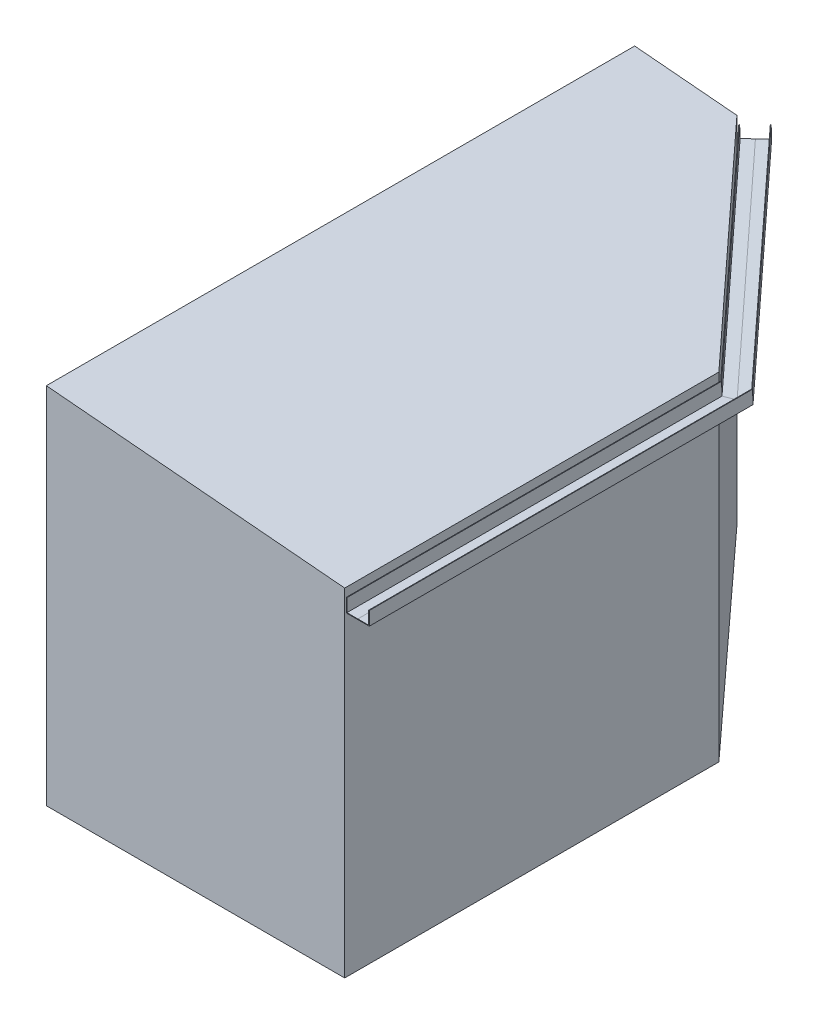
ISO-10303-21;
HEADER;
FILE_DESCRIPTION(('STEP AP214'),'2;1');
FILE_NAME('part.step','',(''),(''),'','','');
FILE_SCHEMA(('AUTOMOTIVE_DESIGN { 1 0 10303 214 1 1 1 1 }'));
ENDSEC;
DATA;
#1=APPLICATION_CONTEXT('core data for automotive mechanical design processes');
#2=APPLICATION_PROTOCOL_DEFINITION('international standard','automotive_design',2000,#1);
#3=PRODUCT_CONTEXT('',#1,'mechanical');
#4=PRODUCT('Part','Part','',(#3));
#5=PRODUCT_RELATED_PRODUCT_CATEGORY('part','',(#4));
#6=PRODUCT_DEFINITION_FORMATION('','',#4);
#7=PRODUCT_DEFINITION_CONTEXT('part definition',#1,'design');
#8=PRODUCT_DEFINITION('design','',#6,#7);
#9=PRODUCT_DEFINITION_SHAPE('','',#8);
#10=(LENGTH_UNIT() NAMED_UNIT(*) SI_UNIT(.MILLI.,.METRE.));
#11=(NAMED_UNIT(*) PLANE_ANGLE_UNIT() SI_UNIT($,.RADIAN.));
#12=(NAMED_UNIT(*) SI_UNIT($,.STERADIAN.) SOLID_ANGLE_UNIT());
#13=UNCERTAINTY_MEASURE_WITH_UNIT(LENGTH_MEASURE(1.E-05),#10,'distance_accuracy_value','');
#14=(GEOMETRIC_REPRESENTATION_CONTEXT(3) GLOBAL_UNCERTAINTY_ASSIGNED_CONTEXT((#13)) GLOBAL_UNIT_ASSIGNED_CONTEXT((#10,
#11,#12)) REPRESENTATION_CONTEXT('',''));
#15=CARTESIAN_POINT('',(0.,0.,0.));
#16=DIRECTION('',(0.,0.,1.));
#17=DIRECTION('',(1.,0.,0.));
#18=AXIS2_PLACEMENT_3D('',#15,#16,#17);
#19=CARTESIAN_POINT('',(184.691152989255,2656.,-3207.30460485348));
#20=DIRECTION('',(0.0229028027264186,0.997996264398468,0.0589823522248682));
#21=DIRECTION('',(0.,-0.0589978275667201,0.998258111082704));
#22=AXIS2_PLACEMENT_3D('',#19,#20,#21);
#23=PLANE('',#22);
#24=DIRECTION('',(-0.738219766957211,-0.0229028027264186,0.674171370870134));
#25=VECTOR('',#24,1.);
#26=CARTESIAN_POINT('',(-1506.91022039486,2803.99594337599,-5054.5857318187));
#27=LINE('',#26,#25);
#28=CARTESIAN_POINT('',(-1562.04870594835,2802.28530663367,-5004.23109481606));
#29=VERTEX_POINT('',#28);
#30=CARTESIAN_POINT('',(-1632.91780357625,2800.08663757194,-4939.51064321253));
#31=VERTEX_POINT('',#30);
#32=EDGE_CURVE('E61',#29,#31,#27,.T.);
#33=ORIENTED_EDGE('',*,*,#32,.F.);
#34=DIRECTION('',(-0.674171370870134,0.0589823522248682,-0.736216031355679));
#35=VECTOR('',#34,1.);
#36=CARTESIAN_POINT('',(110.,2656.,-3178.30208667991));
#37=LINE('',#36,#35);
#38=CARTESIAN_POINT('',(110.,2656.,-3178.30208667991));
#39=VERTEX_POINT('',#38);
#40=EDGE_CURVE('E256',#39,#29,#37,.T.);
#41=ORIENTED_EDGE('',*,*,#40,.F.);
#42=DIRECTION('',(0.932190225959348,0.,-0.361968759184904));
#43=VECTOR('',#42,1.);
#44=CARTESIAN_POINT('',(184.691152989255,2656.,-3207.30460485348));
#45=LINE('',#44,#43);
#46=CARTESIAN_POINT('',(13.9999999999984,2656.,-3141.02535934028));
#47=VERTEX_POINT('',#46);
#48=EDGE_CURVE('E319',#47,#39,#45,.T.);
#49=ORIENTED_EDGE('',*,*,#48,.F.);
#50=DIRECTION('',(-0.674171370870134,0.0589823522248682,-0.736216031355679));
#51=VECTOR('',#50,1.);
#52=CARTESIAN_POINT('',(13.9999999999984,2656.,-3141.02535934028));
#53=LINE('',#52,#51);
#54=EDGE_CURVE('E282',#47,#31,#53,.T.);
#55=ORIENTED_EDGE('',*,*,#54,.T.);
#56=EDGE_LOOP('',(#33,#41,#49,#55));
#57=FACE_BOUND('',#56,.T.);
#58=ADVANCED_FACE('F52',(#57),#23,.F.);
#59=CARTESIAN_POINT('',(184.691152989255,2656.,-3207.30460485348));
#60=DIRECTION('',(0.0229028027264186,0.997996264398468,0.0589823522248682));
#61=DIRECTION('',(0.,-0.0589978275667201,0.998258111082704));
#62=AXIS2_PLACEMENT_3D('',#59,#60,#61);
#63=PLANE('',#62);
#64=DIRECTION('',(-0.738219766957211,-0.0229028027264186,0.674171370870134));
#65=VECTOR('',#64,1.);
#66=CARTESIAN_POINT('',(-1506.91022039486,2803.99594337599,-5054.5857318187));
#67=LINE('',#66,#65);
#68=CARTESIAN_POINT('',(-1491.17960832046,2804.48397569541,-5068.9515464196));
#69=VERTEX_POINT('',#68);
#70=EDGE_CURVE('E95',#69,#29,#67,.T.);
#71=ORIENTED_EDGE('',*,*,#70,.F.);
#72=DIRECTION('',(-0.674171370870134,0.0589823522248682,-0.736216031355679));
#73=VECTOR('',#72,1.);
#74=CARTESIAN_POINT('',(205.999999999999,2656.,-3215.57881401953));
#75=LINE('',#74,#73);
#76=CARTESIAN_POINT('',(205.999999999999,2656.,-3215.57881401953));
#77=VERTEX_POINT('',#76);
#78=EDGE_CURVE('E259',#77,#69,#75,.T.);
#79=ORIENTED_EDGE('',*,*,#78,.F.);
#80=DIRECTION('',(0.932190225959348,0.,-0.361968759184904));
#81=VECTOR('',#80,1.);
#82=CARTESIAN_POINT('',(184.691152989255,2656.,-3207.30460485348));
#83=LINE('',#82,#81);
#84=EDGE_CURVE('E200',#39,#77,#83,.T.);
#85=ORIENTED_EDGE('',*,*,#84,.F.);
#86=ORIENTED_EDGE('',*,*,#40,.T.);
#87=EDGE_LOOP('',(#71,#79,#85,#86));
#88=FACE_BOUND('',#87,.T.);
#89=ADVANCED_FACE('F329',(#88),#63,.F.);
#90=CARTESIAN_POINT('',(205.999999999999,2649.75366925399,-3215.79101300487));
#91=DIRECTION('',(-0.738219766957211,-0.0229028027264188,0.674171370870134));
#92=DIRECTION('',(0.674348254836904,0.,0.738413455455967));
#93=AXIS2_PLACEMENT_3D('',#90,#91,#92);
#94=PLANE('',#93);
#95=DIRECTION('',(-0.0229028027264184,-0.997996264398468,-0.0589823522248684));
#96=VECTOR('',#95,1.);
#97=CARTESIAN_POINT('',(-1491.3226668013,2798.25016094469,-5069.31996969977));
#98=LINE('',#97,#96);
#99=CARTESIAN_POINT('',(-1488.56868880965,2918.25554983683,-5062.22755826596));
#100=VERTEX_POINT('',#99);
#101=EDGE_CURVE('E92',#100,#69,#98,.T.);
#102=ORIENTED_EDGE('',*,*,#101,.F.);
#103=DIRECTION('',(-0.674171370870134,0.0589823522248682,-0.736216031355679));
#104=VECTOR('',#103,1.);
#105=CARTESIAN_POINT('',(205.999999999999,2770.,-3211.70603089105));
#106=LINE('',#105,#104);
#107=CARTESIAN_POINT('',(205.999999999999,2770.,-3211.70603089105));
#108=VERTEX_POINT('',#107);
#109=EDGE_CURVE('E262',#108,#100,#106,.T.);
#110=ORIENTED_EDGE('',*,*,#109,.F.);
#111=DIRECTION('',(0.,0.99942345800426,0.0339521956698988));
#112=VECTOR('',#111,1.);
#113=CARTESIAN_POINT('',(205.999999999999,2649.75366925399,-3215.79101300487));
#114=LINE('',#113,#112);
#115=EDGE_CURVE('E178',#77,#108,#114,.T.);
#116=ORIENTED_EDGE('',*,*,#115,.F.);
#117=ORIENTED_EDGE('',*,*,#78,.T.);
#118=EDGE_LOOP('',(#102,#110,#116,#117));
#119=FACE_BOUND('',#118,.T.);
#120=ADVANCED_FACE('F331',(#119),#94,.F.);
#121=CARTESIAN_POINT('',(265.074976135456,2770.,-3234.64479941185));
#122=DIRECTION('',(-0.0229028027264186,-0.997996264398468,-0.0589823522248682));
#123=DIRECTION('',(0.,0.0589978275667201,-0.998258111082704));
#124=AXIS2_PLACEMENT_3D('',#121,#122,#123);
#125=PLANE('',#124);
#126=DIRECTION('',(0.738219766957211,0.0229028027264186,-0.674171370870134));
#127=VECTOR('',#126,1.);
#128=CARTESIAN_POINT('',(-1444.95837369393,2919.60853236133,-5102.05421591132));
#129=LINE('',#128,#127);
#130=CARTESIAN_POINT('',(-1492.25978764444,2918.1410358232,-5058.85670141161));
#131=VERTEX_POINT('',#130);
#132=EDGE_CURVE('E89',#131,#100,#129,.T.);
#133=ORIENTED_EDGE('',*,*,#132,.F.);
#134=DIRECTION('',(-0.674171370870134,0.0589823522248682,-0.736216031355679));
#135=VECTOR('',#134,1.);
#136=CARTESIAN_POINT('',(200.999999999999,2770.,-3209.76453467545));
#137=LINE('',#136,#135);
#138=CARTESIAN_POINT('',(200.999999999999,2770.,-3209.76453467545));
#139=VERTEX_POINT('',#138);
#140=EDGE_CURVE('E265',#139,#131,#137,.T.);
#141=ORIENTED_EDGE('',*,*,#140,.F.);
#142=DIRECTION('',(-0.932190225959348,0.,0.361968759184904));
#143=VECTOR('',#142,1.);
#144=CARTESIAN_POINT('',(265.074976135456,2770.,-3234.64479941185));
#145=LINE('',#144,#143);
#146=EDGE_CURVE('E255',#108,#139,#145,.T.);
#147=ORIENTED_EDGE('',*,*,#146,.F.);
#148=ORIENTED_EDGE('',*,*,#109,.T.);
#149=EDGE_LOOP('',(#133,#141,#147,#148));
#150=FACE_BOUND('',#149,.T.);
#151=ADVANCED_FACE('F334',(#150),#125,.F.);
#152=CARTESIAN_POINT('',(200.999999999999,2654.68202544116,-3213.6820917481));
#153=DIRECTION('',(0.738219766957211,0.0229028027264188,-0.674171370870134));
#154=DIRECTION('',(-0.674348254836904,0.,-0.738413455455967));
#155=AXIS2_PLACEMENT_3D('',#152,#153,#154);
#156=PLANE('',#155);
#157=DIRECTION('',(0.0229028027264184,0.997996264398468,0.0589823522248684));
#158=VECTOR('',#157,1.);
#159=CARTESIAN_POINT('',(-1494.90089246657,2803.05412799548,-5065.6584268049));
#160=LINE('',#159,#158);
#161=CARTESIAN_POINT('',(-1494.75619314162,2809.35944300377,-5065.28577780412));
#162=VERTEX_POINT('',#161);
#163=EDGE_CURVE('E295',#162,#131,#160,.T.);
#164=ORIENTED_EDGE('',*,*,#163,.F.);
#165=DIRECTION('',(-0.674171370870134,0.0589823522248682,-0.736216031355679));
#166=VECTOR('',#165,1.);
#167=CARTESIAN_POINT('',(200.999999999999,2661.,-3213.46745889478));
#168=LINE('',#167,#166);
#169=CARTESIAN_POINT('',(200.999999999999,2661.,-3213.46745889478));
#170=VERTEX_POINT('',#169);
#171=EDGE_CURVE('E268',#170,#162,#168,.T.);
#172=ORIENTED_EDGE('',*,*,#171,.F.);
#173=DIRECTION('',(0.,-0.99942345800426,-0.0339521956698988));
#174=VECTOR('',#173,1.);
#175=CARTESIAN_POINT('',(200.999999999999,2654.68202544116,-3213.6820917481));
#176=LINE('',#175,#174);
#177=EDGE_CURVE('E302',#139,#170,#176,.T.);
#178=ORIENTED_EDGE('',*,*,#177,.F.);
#179=ORIENTED_EDGE('',*,*,#140,.T.);
#180=EDGE_LOOP('',(#164,#172,#178,#179));
#181=FACE_BOUND('',#180,.T.);
#182=ADVANCED_FACE('F338',(#181),#156,.F.);
#183=CARTESIAN_POINT('',(184.748467417551,2661.,-3207.15700109346));
#184=DIRECTION('',(-0.0229028027264186,-0.997996264398468,-0.0589823522248682));
#185=DIRECTION('',(0.,0.0589978275667201,-0.998258111082704));
#186=AXIS2_PLACEMENT_3D('',#183,#184,#185);
#187=PLANE('',#186);
#188=DIRECTION('',(0.738219766957211,0.0229028027264186,-0.674171370870134));
#189=VECTOR('',#188,1.);
#190=CARTESIAN_POINT('',(-1506.75339573733,2808.98723735903,-5054.32945980427));
#191=LINE('',#190,#189);
#192=CARTESIAN_POINT('',(-1561.93419193472,2807.27528795566,-5003.93618305494));
#193=VERTEX_POINT('',#192);
#194=EDGE_CURVE('E293',#193,#162,#191,.T.);
#195=ORIENTED_EDGE('',*,*,#194,.F.);
#196=DIRECTION('',(-0.674171370870134,0.0589823522248682,-0.736216031355679));
#197=VECTOR('',#196,1.);
#198=CARTESIAN_POINT('',(109.999999999999,2661.,-3178.13222777076));
#199=LINE('',#198,#197);
#200=CARTESIAN_POINT('',(109.999999999999,2661.,-3178.13222777076));
#201=VERTEX_POINT('',#200);
#202=EDGE_CURVE('E271',#201,#193,#199,.T.);
#203=ORIENTED_EDGE('',*,*,#202,.F.);
#204=DIRECTION('',(-0.932190225959348,0.,0.361968759184904));
#205=VECTOR('',#204,1.);
#206=CARTESIAN_POINT('',(184.748467417551,2661.,-3207.15700109346));
#207=LINE('',#206,#205);
#208=EDGE_CURVE('E305',#170,#201,#207,.T.);
#209=ORIENTED_EDGE('',*,*,#208,.F.);
#210=ORIENTED_EDGE('',*,*,#171,.T.);
#211=EDGE_LOOP('',(#195,#203,#209,#210));
#212=FACE_BOUND('',#211,.T.);
#213=ADVANCED_FACE('F391',(#212),#187,.F.);
#214=CARTESIAN_POINT('',(184.748467417551,2661.,-3207.15700109346));
#215=DIRECTION('',(-0.0229028027264186,-0.997996264398468,-0.0589823522248682));
#216=DIRECTION('',(0.,0.0589978275667201,-0.998258111082704));
#217=AXIS2_PLACEMENT_3D('',#214,#215,#216);
#218=PLANE('',#217);
#219=DIRECTION('',(0.738219766957211,0.0229028027264186,-0.674171370870134));
#220=VECTOR('',#219,1.);
#221=CARTESIAN_POINT('',(-1506.75339573733,2808.98723735903,-5054.32945980427));
#222=LINE('',#221,#220);
#223=CARTESIAN_POINT('',(-1629.11219072783,2805.19113290756,-4942.58658830575));
#224=VERTEX_POINT('',#223);
#225=EDGE_CURVE('E289',#224,#193,#222,.T.);
#226=ORIENTED_EDGE('',*,*,#225,.F.);
#227=DIRECTION('',(-0.674171370870134,0.0589823522248682,-0.736216031355679));
#228=VECTOR('',#227,1.);
#229=CARTESIAN_POINT('',(18.9999999999987,2661.,-3142.79699664674));
#230=LINE('',#229,#228);
#231=CARTESIAN_POINT('',(18.9999999999987,2661.,-3142.79699664674));
#232=VERTEX_POINT('',#231);
#233=EDGE_CURVE('E274',#232,#224,#230,.T.);
#234=ORIENTED_EDGE('',*,*,#233,.F.);
#235=DIRECTION('',(-0.932190225959348,0.,0.361968759184904));
#236=VECTOR('',#235,1.);
#237=CARTESIAN_POINT('',(184.748467417551,2661.,-3207.15700109346));
#238=LINE('',#237,#236);
#239=EDGE_CURVE('E308',#201,#232,#238,.T.);
#240=ORIENTED_EDGE('',*,*,#239,.F.);
#241=ORIENTED_EDGE('',*,*,#202,.T.);
#242=EDGE_LOOP('',(#226,#234,#240,#241));
#243=FACE_BOUND('',#242,.T.);
#244=ADVANCED_FACE('F394',(#243),#218,.F.);
#245=CARTESIAN_POINT('',(18.9999999999988,2652.28399144371,-3143.09309498784));
#246=DIRECTION('',(-0.738219766957211,-0.0229028027264186,0.674171370870134));
#247=DIRECTION('',(0.674348254836904,0.,0.738413455455967));
#248=AXIS2_PLACEMENT_3D('',#245,#246,#247);
#249=PLANE('',#248);
#250=DIRECTION('',(-0.0229028027264185,-0.997996264398468,-0.0589823522248683));
#251=VECTOR('',#250,1.);
#252=CARTESIAN_POINT('',(-1629.31181175235,2796.49258892792,-4943.10067899242));
#253=LINE('',#252,#251);
#254=CARTESIAN_POINT('',(-1626.61578523065,2913.97272572699,-4936.15751191325));
#255=VERTEX_POINT('',#254);
#256=EDGE_CURVE('E286',#255,#224,#253,.T.);
#257=ORIENTED_EDGE('',*,*,#256,.F.);
#258=DIRECTION('',(-0.674171370870134,0.0589823522248682,-0.736216031355679));
#259=VECTOR('',#258,1.);
#260=CARTESIAN_POINT('',(18.9999999999987,2770.,-3139.0940724274));
#261=LINE('',#260,#259);
#262=CARTESIAN_POINT('',(18.9999999999987,2770.,-3139.0940724274));
#263=VERTEX_POINT('',#262);
#264=EDGE_CURVE('E277',#263,#255,#261,.T.);
#265=ORIENTED_EDGE('',*,*,#264,.F.);
#266=DIRECTION('',(0.,0.99942345800426,0.0339521956698988));
#267=VECTOR('',#266,1.);
#268=CARTESIAN_POINT('',(18.9999999999988,2652.28399144371,-3143.09309498784));
#269=LINE('',#268,#267);
#270=EDGE_CURVE('E311',#232,#263,#269,.T.);
#271=ORIENTED_EDGE('',*,*,#270,.F.);
#272=ORIENTED_EDGE('',*,*,#233,.T.);
#273=EDGE_LOOP('',(#257,#265,#271,#272));
#274=FACE_BOUND('',#273,.T.);
#275=ADVANCED_FACE('F398',(#274),#249,.F.);
#276=CARTESIAN_POINT('',(102.575974686491,2770.,-3171.54656014128));
#277=DIRECTION('',(-0.0229028027264186,-0.997996264398468,-0.0589823522248682));
#278=DIRECTION('',(0.,0.0589978275667201,-0.998258111082704));
#279=AXIS2_PLACEMENT_3D('',#276,#277,#278);
#280=PLANE('',#279);
#281=DIRECTION('',(0.738219766957211,0.0229028027264186,-0.674171370870134));
#282=VECTOR('',#281,1.);
#283=CARTESIAN_POINT('',(-1564.91834867437,2915.88684978791,-4992.50204133945));
#284=LINE('',#283,#282);
#285=CARTESIAN_POINT('',(-1630.30688406544,2913.85821171336,-4932.78665505889));
#286=VERTEX_POINT('',#285);
#287=EDGE_CURVE('E283',#286,#255,#284,.T.);
#288=ORIENTED_EDGE('',*,*,#287,.F.);
#289=DIRECTION('',(-0.674171370870134,0.0589823522248682,-0.736216031355679));
#290=VECTOR('',#289,1.);
#291=CARTESIAN_POINT('',(13.9999999999983,2770.,-3137.1525762118));
#292=LINE('',#291,#290);
#293=CARTESIAN_POINT('',(13.9999999999983,2770.,-3137.1525762118));
#294=VERTEX_POINT('',#293);
#295=EDGE_CURVE('E280',#294,#286,#292,.T.);
#296=ORIENTED_EDGE('',*,*,#295,.F.);
#297=DIRECTION('',(-0.932190225959348,0.,0.361968759184904));
#298=VECTOR('',#297,1.);
#299=CARTESIAN_POINT('',(102.575974686491,2770.,-3171.54656014128));
#300=LINE('',#299,#298);
#301=EDGE_CURVE('E314',#263,#294,#300,.T.);
#302=ORIENTED_EDGE('',*,*,#301,.F.);
#303=ORIENTED_EDGE('',*,*,#264,.T.);
#304=EDGE_LOOP('',(#288,#296,#302,#303));
#305=FACE_BOUND('',#304,.T.);
#306=ADVANCED_FACE('F401',(#305),#280,.F.);
#307=CARTESIAN_POINT('',(13.9999999999984,2647.22387514679,-3141.3234999391));
#308=DIRECTION('',(0.738219766957211,0.022902802726419,-0.674171370870134));
#309=DIRECTION('',(-0.674348254836904,0.,-0.738413455455967));
#310=AXIS2_PLACEMENT_3D('',#307,#308,#309);
#311=PLANE('',#310);
#312=DIRECTION('',(0.0229028027264183,0.997996264398468,0.0589823522248685));
#313=VECTOR('',#312,1.);
#314=CARTESIAN_POINT('',(-1633.11880143246,2791.32809775253,-4940.02827969979));
#315=LINE('',#314,#313);
#316=EDGE_CURVE('E13',#31,#286,#315,.T.);
#317=ORIENTED_EDGE('',*,*,#316,.F.);
#318=ORIENTED_EDGE('',*,*,#54,.F.);
#319=DIRECTION('',(0.,-0.99942345800426,-0.0339521956698989));
#320=VECTOR('',#319,1.);
#321=CARTESIAN_POINT('',(13.9999999999984,2647.22387514679,-3141.3234999391));
#322=LINE('',#321,#320);
#323=EDGE_CURVE('E317',#294,#47,#322,.T.);
#324=ORIENTED_EDGE('',*,*,#323,.F.);
#325=ORIENTED_EDGE('',*,*,#295,.T.);
#326=EDGE_LOOP('',(#317,#318,#324,#325));
#327=FACE_BOUND('',#326,.T.);
#328=ADVANCED_FACE('F54',(#327),#311,.F.);
#329=CARTESIAN_POINT('',(0.,0.,0.));
#330=DIRECTION('',(0.,0.,-1.));
#331=DIRECTION('',(-1.,0.,0.));
#332=AXIS2_PLACEMENT_3D('',#329,#330,#331);
#333=PLANE('',#332);
#334=DIRECTION('',(0.,1.,0.));
#335=VECTOR('',#334,1.);
#336=CARTESIAN_POINT('',(205.999999999999,2656.,0.));
#337=LINE('',#336,#335);
#338=CARTESIAN_POINT('',(205.999999999999,2656.,0.));
#339=VERTEX_POINT('',#338);
#340=CARTESIAN_POINT('',(205.999999999999,2770.,0.));
#341=VERTEX_POINT('',#340);
#342=EDGE_CURVE('E175',#339,#341,#337,.T.);
#343=ORIENTED_EDGE('',*,*,#342,.T.);
#344=DIRECTION('',(-1.,0.,0.));
#345=VECTOR('',#344,1.);
#346=CARTESIAN_POINT('',(200.999999999999,2770.,0.));
#347=LINE('',#346,#345);
#348=CARTESIAN_POINT('',(200.999999999999,2770.,0.));
#349=VERTEX_POINT('',#348);
#350=EDGE_CURVE('E185',#341,#349,#347,.T.);
#351=ORIENTED_EDGE('',*,*,#350,.T.);
#352=DIRECTION('',(0.,-1.,0.));
#353=VECTOR('',#352,1.);
#354=CARTESIAN_POINT('',(200.999999999999,2661.,0.));
#355=LINE('',#354,#353);
#356=CARTESIAN_POINT('',(200.999999999999,2661.,0.));
#357=VERTEX_POINT('',#356);
#358=EDGE_CURVE('E191',#349,#357,#355,.T.);
#359=ORIENTED_EDGE('',*,*,#358,.T.);
#360=DIRECTION('',(-1.,0.,0.));
#361=VECTOR('',#360,1.);
#362=CARTESIAN_POINT('',(110.,2661.,0.));
#363=LINE('',#362,#361);
#364=CARTESIAN_POINT('',(110.,2661.,0.));
#365=VERTEX_POINT('',#364);
#366=EDGE_CURVE('E204',#357,#365,#363,.T.);
#367=ORIENTED_EDGE('',*,*,#366,.T.);
#368=DIRECTION('',(-1.,0.,0.));
#369=VECTOR('',#368,1.);
#370=CARTESIAN_POINT('',(110.,2661.,0.));
#371=LINE('',#370,#369);
#372=CARTESIAN_POINT('',(18.9999999999993,2661.,0.));
#373=VERTEX_POINT('',#372);
#374=EDGE_CURVE('E208',#365,#373,#371,.T.);
#375=ORIENTED_EDGE('',*,*,#374,.T.);
#376=DIRECTION('',(0.,1.,0.));
#377=VECTOR('',#376,1.);
#378=CARTESIAN_POINT('',(18.9999999999993,2661.,0.));
#379=LINE('',#378,#377);
#380=CARTESIAN_POINT('',(18.9999999999993,2770.,0.));
#381=VERTEX_POINT('',#380);
#382=EDGE_CURVE('E212',#373,#381,#379,.T.);
#383=ORIENTED_EDGE('',*,*,#382,.T.);
#384=DIRECTION('',(-1.,0.,0.));
#385=VECTOR('',#384,1.);
#386=CARTESIAN_POINT('',(13.9999999999989,2770.,0.));
#387=LINE('',#386,#385);
#388=CARTESIAN_POINT('',(13.9999999999989,2770.,0.));
#389=VERTEX_POINT('',#388);
#390=EDGE_CURVE('E216',#381,#389,#387,.T.);
#391=ORIENTED_EDGE('',*,*,#390,.T.);
#392=DIRECTION('',(0.,-1.,0.));
#393=VECTOR('',#392,1.);
#394=CARTESIAN_POINT('',(13.9999999999989,2656.,0.));
#395=LINE('',#394,#393);
#396=CARTESIAN_POINT('',(13.9999999999989,2656.,0.));
#397=VERTEX_POINT('',#396);
#398=EDGE_CURVE('E220',#389,#397,#395,.T.);
#399=ORIENTED_EDGE('',*,*,#398,.T.);
#400=DIRECTION('',(1.,0.,0.));
#401=VECTOR('',#400,1.);
#402=CARTESIAN_POINT('',(110.,2656.,0.));
#403=LINE('',#402,#401);
#404=CARTESIAN_POINT('',(110.,2656.,0.));
#405=VERTEX_POINT('',#404);
#406=EDGE_CURVE('E224',#397,#405,#403,.T.);
#407=ORIENTED_EDGE('',*,*,#406,.T.);
#408=DIRECTION('',(1.,0.,0.));
#409=VECTOR('',#408,1.);
#410=CARTESIAN_POINT('',(110.,2656.,0.));
#411=LINE('',#410,#409);
#412=EDGE_CURVE('E182',#405,#339,#411,.T.);
#413=ORIENTED_EDGE('',*,*,#412,.T.);
#414=EDGE_LOOP('',(#343,#351,#359,#367,#375,#383,#391,#399,#407,#413));
#415=FACE_BOUND('',#414,.T.);
#416=ADVANCED_FACE('F193',(#415),#333,.F.);
#417=CARTESIAN_POINT('',(205.999999999999,2656.,-3399.65922390681));
#418=DIRECTION('',(1.,0.,0.));
#419=DIRECTION('',(0.,1.,0.));
#420=AXIS2_PLACEMENT_3D('',#417,#418,#419);
#421=PLANE('',#420);
#422=DIRECTION('',(0.,0.,1.));
#423=VECTOR('',#422,1.);
#424=CARTESIAN_POINT('',(205.999999999999,2656.,-3399.65922390681));
#425=LINE('',#424,#423);
#426=EDGE_CURVE('E229',#77,#339,#425,.T.);
#427=ORIENTED_EDGE('',*,*,#426,.F.);
#428=ORIENTED_EDGE('',*,*,#115,.T.);
#429=DIRECTION('',(0.,0.,1.));
#430=VECTOR('',#429,1.);
#431=CARTESIAN_POINT('',(205.999999999999,2770.,-3399.65922390681));
#432=LINE('',#431,#430);
#433=EDGE_CURVE('E170',#108,#341,#432,.T.);
#434=ORIENTED_EDGE('',*,*,#433,.T.);
#435=ORIENTED_EDGE('',*,*,#342,.F.);
#436=EDGE_LOOP('',(#427,#428,#434,#435));
#437=FACE_BOUND('',#436,.T.);
#438=ADVANCED_FACE('F173',(#437),#421,.T.);
#439=CARTESIAN_POINT('',(200.999999999999,2770.,-3399.65922390681));
#440=DIRECTION('',(0.,1.,0.));
#441=DIRECTION('',(0.,0.,1.));
#442=AXIS2_PLACEMENT_3D('',#439,#440,#441);
#443=PLANE('',#442);
#444=ORIENTED_EDGE('',*,*,#433,.F.);
#445=ORIENTED_EDGE('',*,*,#146,.T.);
#446=DIRECTION('',(0.,0.,1.));
#447=VECTOR('',#446,1.);
#448=CARTESIAN_POINT('',(200.999999999999,2770.,-3399.65922390681));
#449=LINE('',#448,#447);
#450=EDGE_CURVE('E181',#139,#349,#449,.T.);
#451=ORIENTED_EDGE('',*,*,#450,.T.);
#452=ORIENTED_EDGE('',*,*,#350,.F.);
#453=EDGE_LOOP('',(#444,#445,#451,#452));
#454=FACE_BOUND('',#453,.T.);
#455=ADVANCED_FACE('F186',(#454),#443,.T.);
#456=CARTESIAN_POINT('',(200.999999999999,2661.,-3399.65922390681));
#457=DIRECTION('',(-1.,0.,0.));
#458=DIRECTION('',(0.,-1.,0.));
#459=AXIS2_PLACEMENT_3D('',#456,#457,#458);
#460=PLANE('',#459);
#461=ORIENTED_EDGE('',*,*,#450,.F.);
#462=ORIENTED_EDGE('',*,*,#177,.T.);
#463=DIRECTION('',(0.,0.,1.));
#464=VECTOR('',#463,1.);
#465=CARTESIAN_POINT('',(200.999999999999,2661.,-3399.65922390681));
#466=LINE('',#465,#464);
#467=EDGE_CURVE('E250',#170,#357,#466,.T.);
#468=ORIENTED_EDGE('',*,*,#467,.T.);
#469=ORIENTED_EDGE('',*,*,#358,.F.);
#470=EDGE_LOOP('',(#461,#462,#468,#469));
#471=FACE_BOUND('',#470,.T.);
#472=ADVANCED_FACE('F341',(#471),#460,.T.);
#473=CARTESIAN_POINT('',(109.999999999999,2661.,-3399.65922390681));
#474=DIRECTION('',(0.,1.,0.));
#475=DIRECTION('',(0.,0.,1.));
#476=AXIS2_PLACEMENT_3D('',#473,#474,#475);
#477=PLANE('',#476);
#478=ORIENTED_EDGE('',*,*,#467,.F.);
#479=ORIENTED_EDGE('',*,*,#208,.T.);
#480=DIRECTION('',(0.,0.,1.));
#481=VECTOR('',#480,1.);
#482=CARTESIAN_POINT('',(109.999999999999,2661.,-3399.65922390681));
#483=LINE('',#482,#481);
#484=EDGE_CURVE('E247',#201,#365,#483,.T.);
#485=ORIENTED_EDGE('',*,*,#484,.T.);
#486=ORIENTED_EDGE('',*,*,#366,.F.);
#487=EDGE_LOOP('',(#478,#479,#485,#486));
#488=FACE_BOUND('',#487,.T.);
#489=ADVANCED_FACE('F346',(#488),#477,.T.);
#490=CARTESIAN_POINT('',(109.999999999999,2661.,-3399.65922390681));
#491=DIRECTION('',(0.,1.,0.));
#492=DIRECTION('',(0.,0.,1.));
#493=AXIS2_PLACEMENT_3D('',#490,#491,#492);
#494=PLANE('',#493);
#495=ORIENTED_EDGE('',*,*,#484,.F.);
#496=ORIENTED_EDGE('',*,*,#239,.T.);
#497=DIRECTION('',(0.,0.,1.));
#498=VECTOR('',#497,1.);
#499=CARTESIAN_POINT('',(18.9999999999987,2661.,-3399.65922390681));
#500=LINE('',#499,#498);
#501=EDGE_CURVE('E244',#232,#373,#500,.T.);
#502=ORIENTED_EDGE('',*,*,#501,.T.);
#503=ORIENTED_EDGE('',*,*,#374,.F.);
#504=EDGE_LOOP('',(#495,#496,#502,#503));
#505=FACE_BOUND('',#504,.T.);
#506=ADVANCED_FACE('F349',(#505),#494,.T.);
#507=CARTESIAN_POINT('',(18.9999999999987,2661.,-3399.65922390681));
#508=DIRECTION('',(1.,0.,0.));
#509=DIRECTION('',(0.,0.,-1.));
#510=AXIS2_PLACEMENT_3D('',#507,#508,#509);
#511=PLANE('',#510);
#512=ORIENTED_EDGE('',*,*,#501,.F.);
#513=ORIENTED_EDGE('',*,*,#270,.T.);
#514=DIRECTION('',(0.,0.,1.));
#515=VECTOR('',#514,1.);
#516=CARTESIAN_POINT('',(18.9999999999987,2770.,-3399.65922390681));
#517=LINE('',#516,#515);
#518=EDGE_CURVE('E241',#263,#381,#517,.T.);
#519=ORIENTED_EDGE('',*,*,#518,.T.);
#520=ORIENTED_EDGE('',*,*,#382,.F.);
#521=EDGE_LOOP('',(#512,#513,#519,#520));
#522=FACE_BOUND('',#521,.T.);
#523=ADVANCED_FACE('F354',(#522),#511,.T.);
#524=CARTESIAN_POINT('',(13.9999999999983,2770.,-3399.65922390681));
#525=DIRECTION('',(0.,1.,0.));
#526=DIRECTION('',(0.,0.,1.));
#527=AXIS2_PLACEMENT_3D('',#524,#525,#526);
#528=PLANE('',#527);
#529=ORIENTED_EDGE('',*,*,#518,.F.);
#530=ORIENTED_EDGE('',*,*,#301,.T.);
#531=DIRECTION('',(0.,0.,1.));
#532=VECTOR('',#531,1.);
#533=CARTESIAN_POINT('',(13.9999999999983,2770.,-3399.65922390681));
#534=LINE('',#533,#532);
#535=EDGE_CURVE('E238',#294,#389,#534,.T.);
#536=ORIENTED_EDGE('',*,*,#535,.T.);
#537=ORIENTED_EDGE('',*,*,#390,.F.);
#538=EDGE_LOOP('',(#529,#530,#536,#537));
#539=FACE_BOUND('',#538,.T.);
#540=ADVANCED_FACE('F359',(#539),#528,.T.);
#541=CARTESIAN_POINT('',(13.9999999999983,2656.,-3399.65922390681));
#542=DIRECTION('',(-1.,0.,0.));
#543=DIRECTION('',(0.,-1.,0.));
#544=AXIS2_PLACEMENT_3D('',#541,#542,#543);
#545=PLANE('',#544);
#546=ORIENTED_EDGE('',*,*,#535,.F.);
#547=ORIENTED_EDGE('',*,*,#323,.T.);
#548=DIRECTION('',(0.,0.,1.));
#549=VECTOR('',#548,1.);
#550=CARTESIAN_POINT('',(13.9999999999983,2656.,-3399.65922390681));
#551=LINE('',#550,#549);
#552=EDGE_CURVE('E235',#47,#397,#551,.T.);
#553=ORIENTED_EDGE('',*,*,#552,.T.);
#554=ORIENTED_EDGE('',*,*,#398,.F.);
#555=EDGE_LOOP('',(#546,#547,#553,#554));
#556=FACE_BOUND('',#555,.T.);
#557=ADVANCED_FACE('F363',(#556),#545,.T.);
#558=CARTESIAN_POINT('',(109.999999999999,2656.,-3399.65922390681));
#559=DIRECTION('',(0.,-1.,0.));
#560=DIRECTION('',(0.,0.,-1.));
#561=AXIS2_PLACEMENT_3D('',#558,#559,#560);
#562=PLANE('',#561);
#563=ORIENTED_EDGE('',*,*,#552,.F.);
#564=ORIENTED_EDGE('',*,*,#48,.T.);
#565=DIRECTION('',(0.,0.,1.));
#566=VECTOR('',#565,1.);
#567=CARTESIAN_POINT('',(109.999999999999,2656.,-3399.65922390681));
#568=LINE('',#567,#566);
#569=EDGE_CURVE('E232',#39,#405,#568,.T.);
#570=ORIENTED_EDGE('',*,*,#569,.T.);
#571=ORIENTED_EDGE('',*,*,#406,.F.);
#572=EDGE_LOOP('',(#563,#564,#570,#571));
#573=FACE_BOUND('',#572,.T.);
#574=ADVANCED_FACE('F366',(#573),#562,.T.);
#575=CARTESIAN_POINT('',(109.999999999999,2656.,-3399.65922390681));
#576=DIRECTION('',(0.,-1.,0.));
#577=DIRECTION('',(0.,0.,-1.));
#578=AXIS2_PLACEMENT_3D('',#575,#576,#577);
#579=PLANE('',#578);
#580=ORIENTED_EDGE('',*,*,#569,.F.);
#581=ORIENTED_EDGE('',*,*,#84,.T.);
#582=ORIENTED_EDGE('',*,*,#426,.T.);
#583=ORIENTED_EDGE('',*,*,#412,.F.);
#584=EDGE_LOOP('',(#580,#581,#582,#583));
#585=FACE_BOUND('',#584,.T.);
#586=ADVANCED_FACE('F327',(#585),#579,.T.);
#587=CARTESIAN_POINT('',(-1560.74324619295,2859.17109370439,-5000.86910073925));
#588=DIRECTION('',(-0.674171370870134,0.0589823522248682,-0.736216031355679));
#589=DIRECTION('',(-0.7375,0.,0.675347132962005));
#590=AXIS2_PLACEMENT_3D('',#587,#588,#589);
#591=PLANE('',#590);
#592=ORIENTED_EDGE('',*,*,#32,.T.);
#593=ORIENTED_EDGE('',*,*,#316,.T.);
#594=ORIENTED_EDGE('',*,*,#287,.T.);
#595=ORIENTED_EDGE('',*,*,#256,.T.);
#596=ORIENTED_EDGE('',*,*,#225,.T.);
#597=ORIENTED_EDGE('',*,*,#194,.T.);
#598=ORIENTED_EDGE('',*,*,#163,.T.);
#599=ORIENTED_EDGE('',*,*,#132,.T.);
#600=ORIENTED_EDGE('',*,*,#101,.T.);
#601=ORIENTED_EDGE('',*,*,#70,.T.);
#602=EDGE_LOOP('',(#592,#593,#594,#595,#596,#597,#598,#599,#600,#601));
#603=FACE_BOUND('',#602,.T.);
#604=ADVANCED_FACE('F373',(#603),#591,.T.);
#605=CLOSED_SHELL('',(#58,#89,#120,#151,#182,#213,#244,#275,#306,#328,#416,#438,#455,#472,#489,
#506,#523,#540,#557,#574,#586,#604));
#606=MANIFOLD_SOLID_BREP('B2',#605);
#607=CARTESIAN_POINT('',(-1643.22482801523,3048.54,-4930.));
#608=DIRECTION('',(-0.7375,0.,0.675347132962005));
#609=DIRECTION('',(0.675347132962005,0.,0.7375));
#610=AXIS2_PLACEMENT_3D('',#607,#608,#609);
#611=PLANE('',#610);
#612=DIRECTION('',(0.,-1.,0.));
#613=VECTOR('',#612,1.);
#614=CARTESIAN_POINT('',(-1643.22482801523,3048.54,-4930.));
#615=LINE('',#614,#613);
#616=CARTESIAN_POINT('',(-1643.22482801523,2973.58188526086,-4930.));
#617=VERTEX_POINT('',#616);
#618=CARTESIAN_POINT('',(-1643.22482801523,0.,-4930.));
#619=VERTEX_POINT('',#618);
#620=EDGE_CURVE('E50',#617,#619,#615,.T.);
#621=ORIENTED_EDGE('',*,*,#620,.F.);
#622=DIRECTION('',(0.674171370870133,-0.0589823522248682,0.736216031355679));
#623=VECTOR('',#622,1.);
#624=CARTESIAN_POINT('',(-1646.20547847503,2973.84265838602,-4933.25496268039));
#625=LINE('',#624,#623);
#626=CARTESIAN_POINT('',(0.,2829.81834118519,-3135.54755989553));
#627=VERTEX_POINT('',#626);
#628=EDGE_CURVE('E638',#617,#627,#625,.T.);
#629=ORIENTED_EDGE('',*,*,#628,.T.);
#630=DIRECTION('',(0.,-1.,0.));
#631=VECTOR('',#630,1.);
#632=CARTESIAN_POINT('',(-5.27355936696949E-13,3048.54,-3135.54755989553));
#633=LINE('',#632,#631);
#634=CARTESIAN_POINT('',(-5.27355936696949E-13,0.,-3135.54755989553));
#635=VERTEX_POINT('',#634);
#636=EDGE_CURVE('E609',#627,#635,#633,.T.);
#637=ORIENTED_EDGE('',*,*,#636,.T.);
#638=DIRECTION('',(-0.675347132962005,0.,-0.7375));
#639=VECTOR('',#638,1.);
#640=CARTESIAN_POINT('',(-1643.22482801523,0.,-4930.));
#641=LINE('',#640,#639);
#642=EDGE_CURVE('E623',#635,#619,#641,.T.);
#643=ORIENTED_EDGE('',*,*,#642,.T.);
#644=EDGE_LOOP('',(#621,#629,#637,#643));
#645=FACE_BOUND('',#644,.T.);
#646=ADVANCED_FACE('F560',(#645),#611,.F.);
#647=CARTESIAN_POINT('',(-2500.,3048.54,-4930.));
#648=DIRECTION('',(0.,0.,1.));
#649=DIRECTION('',(1.,0.,0.));
#650=AXIS2_PLACEMENT_3D('',#647,#648,#649);
#651=PLANE('',#650);
#652=DIRECTION('',(0.,-1.,0.));
#653=VECTOR('',#652,1.);
#654=CARTESIAN_POINT('',(-2500.,3048.54,-4930.));
#655=LINE('',#654,#653);
#656=CARTESIAN_POINT('',(-2500.,3048.54,-4930.));
#657=VERTEX_POINT('',#656);
#658=CARTESIAN_POINT('',(-2500.,0.,-4930.));
#659=VERTEX_POINT('',#658);
#660=EDGE_CURVE('E568',#657,#659,#655,.T.);
#661=ORIENTED_EDGE('',*,*,#660,.F.);
#662=DIRECTION('',(0.996194698091746,-0.0871557427476584,0.));
#663=VECTOR('',#662,1.);
#664=CARTESIAN_POINT('',(-2500.,3048.54,-4930.));
#665=LINE('',#664,#663);
#666=EDGE_CURVE('E575',#657,#617,#665,.T.);
#667=ORIENTED_EDGE('',*,*,#666,.T.);
#668=ORIENTED_EDGE('',*,*,#620,.T.);
#669=DIRECTION('',(-1.,0.,0.));
#670=VECTOR('',#669,1.);
#671=CARTESIAN_POINT('',(-2500.,0.,-4930.));
#672=LINE('',#671,#670);
#673=EDGE_CURVE('E635',#619,#659,#672,.T.);
#674=ORIENTED_EDGE('',*,*,#673,.T.);
#675=EDGE_LOOP('',(#661,#667,#668,#674));
#676=FACE_BOUND('',#675,.T.);
#677=ADVANCED_FACE('F648',(#676),#651,.F.);
#678=CARTESIAN_POINT('',(-2500.,3048.54,-4930.));
#679=DIRECTION('',(1.,0.,0.));
#680=DIRECTION('',(0.,0.,-1.));
#681=AXIS2_PLACEMENT_3D('',#678,#679,#680);
#682=PLANE('',#681);
#683=DIRECTION('',(0.,0.,1.));
#684=VECTOR('',#683,1.);
#685=CARTESIAN_POINT('',(-2500.,0.,-4930.));
#686=LINE('',#685,#684);
#687=CARTESIAN_POINT('',(-2500.,0.,0.));
#688=VERTEX_POINT('',#687);
#689=EDGE_CURVE('E618',#659,#688,#686,.T.);
#690=ORIENTED_EDGE('',*,*,#689,.T.);
#691=DIRECTION('',(0.,-1.,0.));
#692=VECTOR('',#691,1.);
#693=CARTESIAN_POINT('',(-2500.,3048.54,0.));
#694=LINE('',#693,#692);
#695=CARTESIAN_POINT('',(-2500.,3048.54,0.));
#696=VERTEX_POINT('',#695);
#697=EDGE_CURVE('E608',#696,#688,#694,.T.);
#698=ORIENTED_EDGE('',*,*,#697,.F.);
#699=DIRECTION('',(0.,0.,1.));
#700=VECTOR('',#699,1.);
#701=CARTESIAN_POINT('',(-2500.,3048.54,-4930.));
#702=LINE('',#701,#700);
#703=EDGE_CURVE('E624',#657,#696,#702,.T.);
#704=ORIENTED_EDGE('',*,*,#703,.F.);
#705=ORIENTED_EDGE('',*,*,#660,.T.);
#706=EDGE_LOOP('',(#690,#698,#704,#705));
#707=FACE_BOUND('',#706,.T.);
#708=ADVANCED_FACE('F633',(#707),#682,.F.);
#709=CARTESIAN_POINT('',(-2500.,3048.54,0.));
#710=DIRECTION('',(0.,0.,-1.));
#711=DIRECTION('',(-1.,0.,0.));
#712=AXIS2_PLACEMENT_3D('',#709,#710,#711);
#713=PLANE('',#712);
#714=DIRECTION('',(0.,-1.,0.));
#715=VECTOR('',#714,1.);
#716=CARTESIAN_POINT('',(0.,3048.54,0.));
#717=LINE('',#716,#715);
#718=CARTESIAN_POINT('',(0.,2829.81834118519,0.));
#719=VERTEX_POINT('',#718);
#720=CARTESIAN_POINT('',(0.,0.,0.));
#721=VERTEX_POINT('',#720);
#722=EDGE_CURVE('E595',#719,#721,#717,.T.);
#723=ORIENTED_EDGE('',*,*,#722,.F.);
#724=DIRECTION('',(0.996194698091746,-0.0871557427476584,0.));
#725=VECTOR('',#724,1.);
#726=CARTESIAN_POINT('',(-2500.,3048.54,0.));
#727=LINE('',#726,#725);
#728=EDGE_CURVE('E643',#696,#719,#727,.T.);
#729=ORIENTED_EDGE('',*,*,#728,.F.);
#730=ORIENTED_EDGE('',*,*,#697,.T.);
#731=DIRECTION('',(1.,0.,0.));
#732=VECTOR('',#731,1.);
#733=CARTESIAN_POINT('',(-2500.,0.,0.));
#734=LINE('',#733,#732);
#735=EDGE_CURVE('E613',#688,#721,#734,.T.);
#736=ORIENTED_EDGE('',*,*,#735,.T.);
#737=EDGE_LOOP('',(#723,#729,#730,#736));
#738=FACE_BOUND('',#737,.T.);
#739=ADVANCED_FACE('F614',(#738),#713,.F.);
#740=CARTESIAN_POINT('',(-5.27355936696949E-13,3048.54,-3135.54755989553));
#741=DIRECTION('',(-1.,0.,0.));
#742=DIRECTION('',(0.,0.,1.));
#743=AXIS2_PLACEMENT_3D('',#740,#741,#742);
#744=PLANE('',#743);
#745=ORIENTED_EDGE('',*,*,#636,.F.);
#746=DIRECTION('',(0.,0.,1.));
#747=VECTOR('',#746,1.);
#748=CARTESIAN_POINT('',(0.,2829.81834118519,-4930.));
#749=LINE('',#748,#747);
#750=EDGE_CURVE('E604',#627,#719,#749,.T.);
#751=ORIENTED_EDGE('',*,*,#750,.T.);
#752=ORIENTED_EDGE('',*,*,#722,.T.);
#753=DIRECTION('',(0.,0.,-1.));
#754=VECTOR('',#753,1.);
#755=CARTESIAN_POINT('',(-5.27355936696949E-13,0.,-3135.54755989553));
#756=LINE('',#755,#754);
#757=EDGE_CURVE('E600',#721,#635,#756,.T.);
#758=ORIENTED_EDGE('',*,*,#757,.T.);
#759=EDGE_LOOP('',(#745,#751,#752,#758));
#760=FACE_BOUND('',#759,.T.);
#761=ADVANCED_FACE('F598',(#760),#744,.F.);
#762=CARTESIAN_POINT('',(0.,0.,0.));
#763=DIRECTION('',(0.,1.,0.));
#764=DIRECTION('',(0.,0.,1.));
#765=AXIS2_PLACEMENT_3D('',#762,#763,#764);
#766=PLANE('',#765);
#767=ORIENTED_EDGE('',*,*,#642,.F.);
#768=ORIENTED_EDGE('',*,*,#757,.F.);
#769=ORIENTED_EDGE('',*,*,#735,.F.);
#770=ORIENTED_EDGE('',*,*,#689,.F.);
#771=ORIENTED_EDGE('',*,*,#673,.F.);
#772=EDGE_LOOP('',(#767,#768,#769,#770,#771));
#773=FACE_BOUND('',#772,.T.);
#774=ADVANCED_FACE('F620',(#773),#766,.F.);
#775=CARTESIAN_POINT('',(-2500.,3048.54,-4930.));
#776=DIRECTION('',(-0.0871557427476584,-0.996194698091746,0.));
#777=DIRECTION('',(0.996194698091746,-0.0871557427476584,0.));
#778=AXIS2_PLACEMENT_3D('',#775,#776,#777);
#779=PLANE('',#778);
#780=ORIENTED_EDGE('',*,*,#666,.F.);
#781=ORIENTED_EDGE('',*,*,#703,.T.);
#782=ORIENTED_EDGE('',*,*,#728,.T.);
#783=ORIENTED_EDGE('',*,*,#750,.F.);
#784=ORIENTED_EDGE('',*,*,#628,.F.);
#785=EDGE_LOOP('',(#780,#781,#782,#783,#784));
#786=FACE_BOUND('',#785,.T.);
#787=ADVANCED_FACE('F650',(#786),#779,.F.);
#788=CLOSED_SHELL('',(#646,#677,#708,#739,#761,#774,#787));
#789=MANIFOLD_SOLID_BREP('B7',#788);
#790=ADVANCED_BREP_SHAPE_REPRESENTATION('',(#18,#606,#789),#14);
#791=SHAPE_DEFINITION_REPRESENTATION(#9,#790);
ENDSEC;
END-ISO-10303-21;
